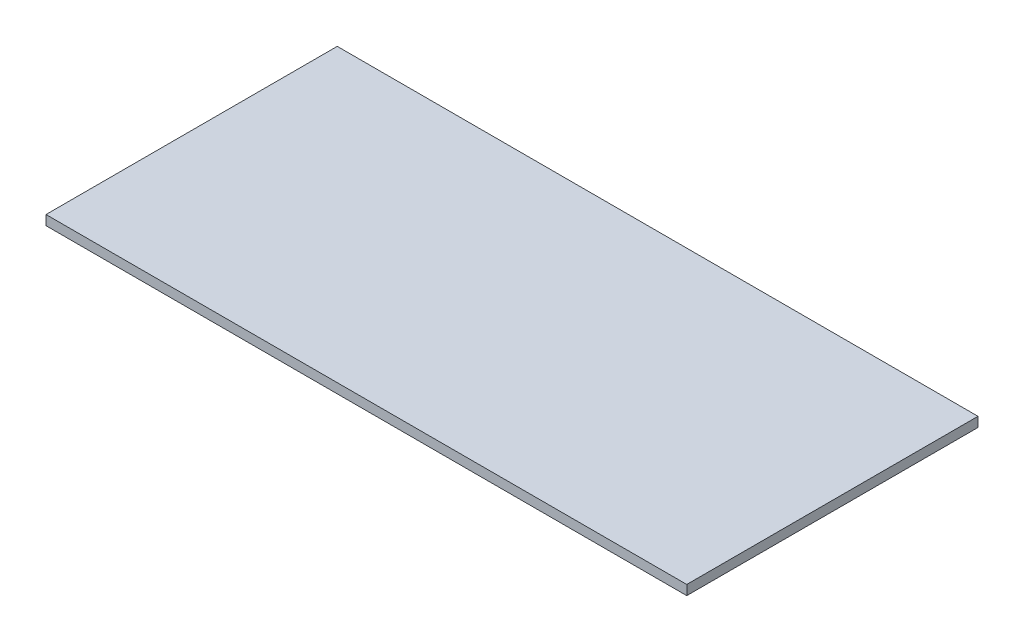
ISO-10303-21;
HEADER;
FILE_DESCRIPTION(('STEP AP214'),'2;1');
FILE_NAME('part.step','',(''),(''),'','','');
FILE_SCHEMA(('AUTOMOTIVE_DESIGN { 1 0 10303 214 1 1 1 1 }'));
ENDSEC;
DATA;
#1=APPLICATION_CONTEXT('core data for automotive mechanical design processes');
#2=APPLICATION_PROTOCOL_DEFINITION('international standard','automotive_design',2000,#1);
#3=PRODUCT_CONTEXT('',#1,'mechanical');
#4=PRODUCT('Part','Part','',(#3));
#5=PRODUCT_RELATED_PRODUCT_CATEGORY('part','',(#4));
#6=PRODUCT_DEFINITION_FORMATION('','',#4);
#7=PRODUCT_DEFINITION_CONTEXT('part definition',#1,'design');
#8=PRODUCT_DEFINITION('design','',#6,#7);
#9=PRODUCT_DEFINITION_SHAPE('','',#8);
#10=(LENGTH_UNIT() NAMED_UNIT(*) SI_UNIT(.MILLI.,.METRE.));
#11=(NAMED_UNIT(*) PLANE_ANGLE_UNIT() SI_UNIT($,.RADIAN.));
#12=(NAMED_UNIT(*) SI_UNIT($,.STERADIAN.) SOLID_ANGLE_UNIT());
#13=UNCERTAINTY_MEASURE_WITH_UNIT(LENGTH_MEASURE(1.E-05),#10,'distance_accuracy_value','');
#14=(GEOMETRIC_REPRESENTATION_CONTEXT(3) GLOBAL_UNCERTAINTY_ASSIGNED_CONTEXT((#13)) GLOBAL_UNIT_ASSIGNED_CONTEXT((#10,
#11,#12)) REPRESENTATION_CONTEXT('',''));
#15=CARTESIAN_POINT('',(0.,0.,0.));
#16=DIRECTION('',(0.,0.,1.));
#17=DIRECTION('',(1.,0.,0.));
#18=AXIS2_PLACEMENT_3D('',#15,#16,#17);
#19=CARTESIAN_POINT('',(0.,1.27,0.));
#20=DIRECTION('',(1.,0.,0.));
#21=DIRECTION('',(0.,0.,-1.));
#22=AXIS2_PLACEMENT_3D('',#19,#20,#21);
#23=PLANE('',#22);
#24=DIRECTION('',(0.,0.,1.));
#25=VECTOR('',#24,1.);
#26=CARTESIAN_POINT('',(0.,0.,0.));
#27=LINE('',#26,#25);
#28=CARTESIAN_POINT('',(0.,0.,0.));
#29=VERTEX_POINT('',#28);
#30=CARTESIAN_POINT('',(0.,0.,38.1));
#31=VERTEX_POINT('',#30);
#32=EDGE_CURVE('E107',#29,#31,#27,.T.);
#33=ORIENTED_EDGE('',*,*,#32,.T.);
#34=DIRECTION('',(0.,-1.,0.));
#35=VECTOR('',#34,1.);
#36=CARTESIAN_POINT('',(0.,1.27,38.1));
#37=LINE('',#36,#35);
#38=CARTESIAN_POINT('',(0.,1.27,38.1));
#39=VERTEX_POINT('',#38);
#40=EDGE_CURVE('E11',#39,#31,#37,.T.);
#41=ORIENTED_EDGE('',*,*,#40,.F.);
#42=DIRECTION('',(0.,0.,1.));
#43=VECTOR('',#42,1.);
#44=CARTESIAN_POINT('',(0.,1.27,0.));
#45=LINE('',#44,#43);
#46=CARTESIAN_POINT('',(0.,1.27,0.));
#47=VERTEX_POINT('',#46);
#48=EDGE_CURVE('E91',#47,#39,#45,.T.);
#49=ORIENTED_EDGE('',*,*,#48,.F.);
#50=DIRECTION('',(0.,-1.,0.));
#51=VECTOR('',#50,1.);
#52=CARTESIAN_POINT('',(0.,1.27,0.));
#53=LINE('',#52,#51);
#54=EDGE_CURVE('E103',#47,#29,#53,.T.);
#55=ORIENTED_EDGE('',*,*,#54,.T.);
#56=EDGE_LOOP('',(#33,#41,#49,#55));
#57=FACE_BOUND('',#56,.T.);
#58=ADVANCED_FACE('F39',(#57),#23,.F.);
#59=CARTESIAN_POINT('',(0.,1.27,38.1));
#60=DIRECTION('',(0.,0.,-1.));
#61=DIRECTION('',(-1.,0.,0.));
#62=AXIS2_PLACEMENT_3D('',#59,#60,#61);
#63=PLANE('',#62);
#64=DIRECTION('',(1.,0.,0.));
#65=VECTOR('',#64,1.);
#66=CARTESIAN_POINT('',(0.,0.,38.1));
#67=LINE('',#66,#65);
#68=CARTESIAN_POINT('',(83.82,0.,38.1));
#69=VERTEX_POINT('',#68);
#70=EDGE_CURVE('E96',#31,#69,#67,.T.);
#71=ORIENTED_EDGE('',*,*,#70,.T.);
#72=DIRECTION('',(0.,-1.,0.));
#73=VECTOR('',#72,1.);
#74=CARTESIAN_POINT('',(83.82,1.27,38.1));
#75=LINE('',#74,#73);
#76=CARTESIAN_POINT('',(83.82,1.27,38.1));
#77=VERTEX_POINT('',#76);
#78=EDGE_CURVE('E48',#77,#69,#75,.T.);
#79=ORIENTED_EDGE('',*,*,#78,.F.);
#80=DIRECTION('',(1.,0.,0.));
#81=VECTOR('',#80,1.);
#82=CARTESIAN_POINT('',(0.,1.27,38.1));
#83=LINE('',#82,#81);
#84=EDGE_CURVE('E86',#39,#77,#83,.T.);
#85=ORIENTED_EDGE('',*,*,#84,.F.);
#86=ORIENTED_EDGE('',*,*,#40,.T.);
#87=EDGE_LOOP('',(#71,#79,#85,#86));
#88=FACE_BOUND('',#87,.T.);
#89=ADVANCED_FACE('F95',(#88),#63,.F.);
#90=CARTESIAN_POINT('',(83.82,1.27,0.));
#91=DIRECTION('',(-1.,0.,0.));
#92=DIRECTION('',(0.,0.,1.));
#93=AXIS2_PLACEMENT_3D('',#90,#91,#92);
#94=PLANE('',#93);
#95=DIRECTION('',(0.,0.,-1.));
#96=VECTOR('',#95,1.);
#97=CARTESIAN_POINT('',(83.82,0.,0.));
#98=LINE('',#97,#96);
#99=CARTESIAN_POINT('',(83.82,0.,0.));
#100=VERTEX_POINT('',#99);
#101=EDGE_CURVE('E73',#69,#100,#98,.T.);
#102=ORIENTED_EDGE('',*,*,#101,.T.);
#103=DIRECTION('',(0.,-1.,0.));
#104=VECTOR('',#103,1.);
#105=CARTESIAN_POINT('',(83.82,1.27,0.));
#106=LINE('',#105,#104);
#107=CARTESIAN_POINT('',(83.82,1.27,0.));
#108=VERTEX_POINT('',#107);
#109=EDGE_CURVE('E98',#108,#100,#106,.T.);
#110=ORIENTED_EDGE('',*,*,#109,.F.);
#111=DIRECTION('',(0.,0.,-1.));
#112=VECTOR('',#111,1.);
#113=CARTESIAN_POINT('',(83.82,1.27,0.));
#114=LINE('',#113,#112);
#115=EDGE_CURVE('E89',#77,#108,#114,.T.);
#116=ORIENTED_EDGE('',*,*,#115,.F.);
#117=ORIENTED_EDGE('',*,*,#78,.T.);
#118=EDGE_LOOP('',(#102,#110,#116,#117));
#119=FACE_BOUND('',#118,.T.);
#120=ADVANCED_FACE('F99',(#119),#94,.F.);
#121=CARTESIAN_POINT('',(0.,1.27,0.));
#122=DIRECTION('',(0.,0.,1.));
#123=DIRECTION('',(1.,0.,0.));
#124=AXIS2_PLACEMENT_3D('',#121,#122,#123);
#125=PLANE('',#124);
#126=DIRECTION('',(-1.,0.,0.));
#127=VECTOR('',#126,1.);
#128=CARTESIAN_POINT('',(0.,0.,0.));
#129=LINE('',#128,#127);
#130=EDGE_CURVE('E79',#100,#29,#129,.T.);
#131=ORIENTED_EDGE('',*,*,#130,.T.);
#132=ORIENTED_EDGE('',*,*,#54,.F.);
#133=DIRECTION('',(-1.,0.,0.));
#134=VECTOR('',#133,1.);
#135=CARTESIAN_POINT('',(0.,1.27,0.));
#136=LINE('',#135,#134);
#137=EDGE_CURVE('E56',#108,#47,#136,.T.);
#138=ORIENTED_EDGE('',*,*,#137,.F.);
#139=ORIENTED_EDGE('',*,*,#109,.T.);
#140=EDGE_LOOP('',(#131,#132,#138,#139));
#141=FACE_BOUND('',#140,.T.);
#142=ADVANCED_FACE('F120',(#141),#125,.F.);
#143=CARTESIAN_POINT('',(0.,1.27,0.));
#144=DIRECTION('',(0.,1.,0.));
#145=DIRECTION('',(0.,0.,1.));
#146=AXIS2_PLACEMENT_3D('',#143,#144,#145);
#147=PLANE('',#146);
#148=ORIENTED_EDGE('',*,*,#48,.T.);
#149=ORIENTED_EDGE('',*,*,#84,.T.);
#150=ORIENTED_EDGE('',*,*,#115,.T.);
#151=ORIENTED_EDGE('',*,*,#137,.T.);
#152=EDGE_LOOP('',(#148,#149,#150,#151));
#153=FACE_BOUND('',#152,.T.);
#154=ADVANCED_FACE('F87',(#153),#147,.T.);
#155=CARTESIAN_POINT('',(0.,0.,0.));
#156=DIRECTION('',(0.,1.,0.));
#157=DIRECTION('',(0.,0.,1.));
#158=AXIS2_PLACEMENT_3D('',#155,#156,#157);
#159=PLANE('',#158);
#160=ORIENTED_EDGE('',*,*,#32,.F.);
#161=ORIENTED_EDGE('',*,*,#130,.F.);
#162=ORIENTED_EDGE('',*,*,#101,.F.);
#163=ORIENTED_EDGE('',*,*,#70,.F.);
#164=EDGE_LOOP('',(#160,#161,#162,#163));
#165=FACE_BOUND('',#164,.T.);
#166=ADVANCED_FACE('F123',(#165),#159,.F.);
#167=CLOSED_SHELL('',(#58,#89,#120,#142,#154,#166));
#168=MANIFOLD_SOLID_BREP('B2',#167);
#169=ADVANCED_BREP_SHAPE_REPRESENTATION('',(#18,#168),#14);
#170=SHAPE_DEFINITION_REPRESENTATION(#9,#169);
ENDSEC;
END-ISO-10303-21;
